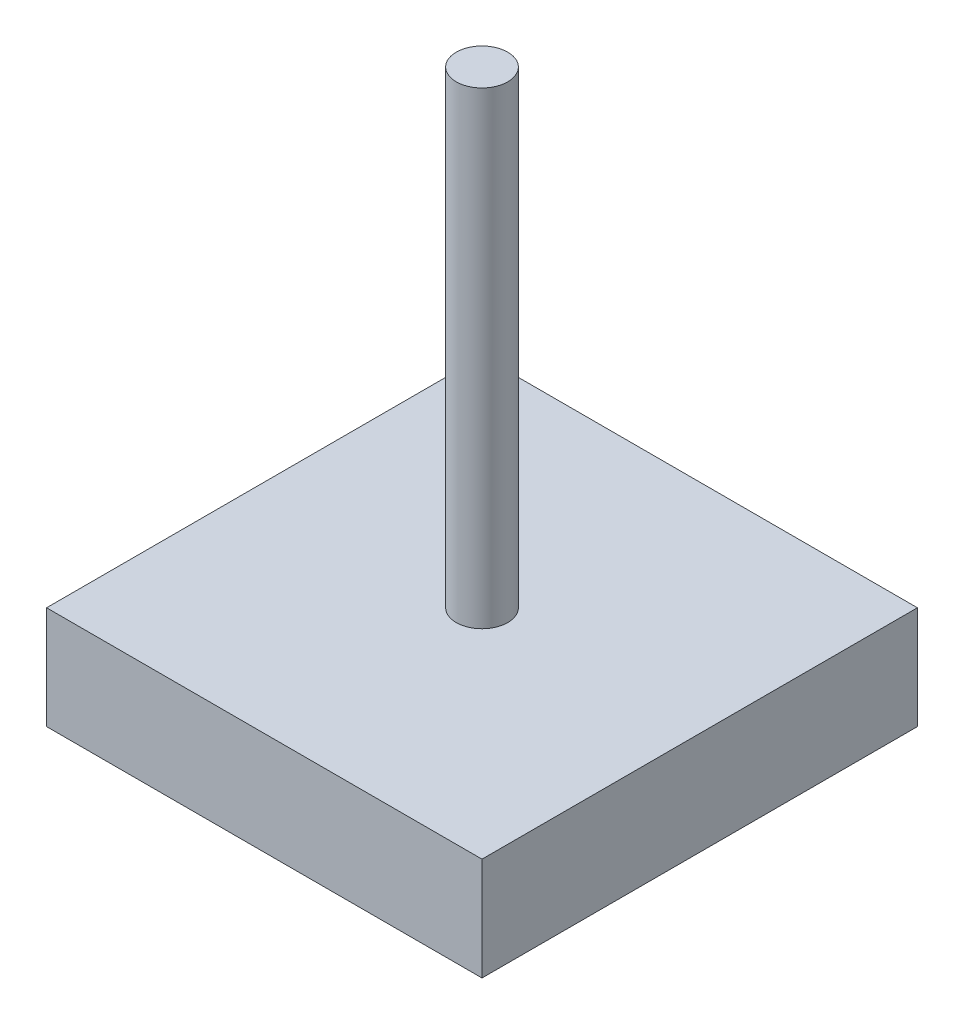
ISO-10303-21;
HEADER;
FILE_DESCRIPTION(('STEP AP214'),'2;1');
FILE_NAME('part.step','',(''),(''),'','','');
FILE_SCHEMA(('AUTOMOTIVE_DESIGN { 1 0 10303 214 1 1 1 1 }'));
ENDSEC;
DATA;
#1=APPLICATION_CONTEXT('core data for automotive mechanical design processes');
#2=APPLICATION_PROTOCOL_DEFINITION('international standard','automotive_design',2000,#1);
#3=PRODUCT_CONTEXT('',#1,'mechanical');
#4=PRODUCT('Part','Part','',(#3));
#5=PRODUCT_RELATED_PRODUCT_CATEGORY('part','',(#4));
#6=PRODUCT_DEFINITION_FORMATION('','',#4);
#7=PRODUCT_DEFINITION_CONTEXT('part definition',#1,'design');
#8=PRODUCT_DEFINITION('design','',#6,#7);
#9=PRODUCT_DEFINITION_SHAPE('','',#8);
#10=(LENGTH_UNIT() NAMED_UNIT(*) SI_UNIT(.MILLI.,.METRE.));
#11=(NAMED_UNIT(*) PLANE_ANGLE_UNIT() SI_UNIT($,.RADIAN.));
#12=(NAMED_UNIT(*) SI_UNIT($,.STERADIAN.) SOLID_ANGLE_UNIT());
#13=UNCERTAINTY_MEASURE_WITH_UNIT(LENGTH_MEASURE(1.E-05),#10,'distance_accuracy_value','');
#14=(GEOMETRIC_REPRESENTATION_CONTEXT(3) GLOBAL_UNCERTAINTY_ASSIGNED_CONTEXT((#13)) GLOBAL_UNIT_ASSIGNED_CONTEXT((#10,
#11,#12)) REPRESENTATION_CONTEXT('',''));
#15=CARTESIAN_POINT('',(0.,0.,0.));
#16=DIRECTION('',(0.,0.,1.));
#17=DIRECTION('',(1.,0.,0.));
#18=AXIS2_PLACEMENT_3D('',#15,#16,#17);
#19=CARTESIAN_POINT('',(0.,10.,0.));
#20=DIRECTION('',(0.,-1.,0.));
#21=DIRECTION('',(0.,0.,-1.));
#22=AXIS2_PLACEMENT_3D('',#19,#20,#21);
#23=PLANE('',#22);
#24=DIRECTION('',(0.,0.,1.));
#25=VECTOR('',#24,1.);
#26=CARTESIAN_POINT('',(-21.15,10.,-21.15));
#27=LINE('',#26,#25);
#28=CARTESIAN_POINT('',(-21.15,10.,-21.15));
#29=VERTEX_POINT('',#28);
#30=CARTESIAN_POINT('',(-21.15,10.,21.15));
#31=VERTEX_POINT('',#30);
#32=EDGE_CURVE('E86',#29,#31,#27,.T.);
#33=ORIENTED_EDGE('',*,*,#32,.T.);
#34=DIRECTION('',(1.,0.,0.));
#35=VECTOR('',#34,1.);
#36=CARTESIAN_POINT('',(21.15,10.,21.15));
#37=LINE('',#36,#35);
#38=CARTESIAN_POINT('',(21.15,10.,21.15));
#39=VERTEX_POINT('',#38);
#40=EDGE_CURVE('E81',#31,#39,#37,.T.);
#41=ORIENTED_EDGE('',*,*,#40,.T.);
#42=DIRECTION('',(0.,0.,-1.));
#43=VECTOR('',#42,1.);
#44=CARTESIAN_POINT('',(21.15,10.,-21.15));
#45=LINE('',#44,#43);
#46=CARTESIAN_POINT('',(21.15,10.,-21.15));
#47=VERTEX_POINT('',#46);
#48=EDGE_CURVE('E84',#39,#47,#45,.T.);
#49=ORIENTED_EDGE('',*,*,#48,.T.);
#50=DIRECTION('',(-1.,0.,0.));
#51=VECTOR('',#50,1.);
#52=CARTESIAN_POINT('',(21.15,10.,-21.15));
#53=LINE('',#52,#51);
#54=EDGE_CURVE('E50',#47,#29,#53,.T.);
#55=ORIENTED_EDGE('',*,*,#54,.T.);
#56=EDGE_LOOP('',(#33,#41,#49,#55));
#57=FACE_BOUND('',#56,.T.);
#58=CARTESIAN_POINT('',(0.,10.,0.));
#59=DIRECTION('',(0.,-1.,0.));
#60=DIRECTION('',(0.,0.,-1.));
#61=AXIS2_PLACEMENT_3D('',#58,#59,#60);
#62=CIRCLE('',#61,2.5);
#63=CARTESIAN_POINT('',(0.,10.,-2.5));
#64=VERTEX_POINT('',#63);
#65=EDGE_CURVE('E11',#64,#64,#62,.F.);
#66=ORIENTED_EDGE('',*,*,#65,.F.);
#67=EDGE_LOOP('',(#66));
#68=FACE_BOUND('',#67,.T.);
#69=ADVANCED_FACE('F33',(#57,#68),#23,.F.);
#70=CARTESIAN_POINT('',(-21.15,10.,-21.15));
#71=DIRECTION('',(1.,0.,0.));
#72=DIRECTION('',(0.,0.,-1.));
#73=AXIS2_PLACEMENT_3D('',#70,#71,#72);
#74=PLANE('',#73);
#75=DIRECTION('',(0.,0.,1.));
#76=VECTOR('',#75,1.);
#77=CARTESIAN_POINT('',(-21.15,0.,-21.15));
#78=LINE('',#77,#76);
#79=CARTESIAN_POINT('',(-21.15,0.,-21.15));
#80=VERTEX_POINT('',#79);
#81=CARTESIAN_POINT('',(-21.15,0.,21.15));
#82=VERTEX_POINT('',#81);
#83=EDGE_CURVE('E100',#80,#82,#78,.T.);
#84=ORIENTED_EDGE('',*,*,#83,.T.);
#85=DIRECTION('',(0.,-1.,0.));
#86=VECTOR('',#85,1.);
#87=CARTESIAN_POINT('',(-21.15,10.,21.15));
#88=LINE('',#87,#86);
#89=EDGE_CURVE('E42',#31,#82,#88,.T.);
#90=ORIENTED_EDGE('',*,*,#89,.F.);
#91=ORIENTED_EDGE('',*,*,#32,.F.);
#92=DIRECTION('',(0.,-1.,0.));
#93=VECTOR('',#92,1.);
#94=CARTESIAN_POINT('',(-21.15,10.,-21.15));
#95=LINE('',#94,#93);
#96=EDGE_CURVE('E96',#29,#80,#95,.T.);
#97=ORIENTED_EDGE('',*,*,#96,.T.);
#98=EDGE_LOOP('',(#84,#90,#91,#97));
#99=FACE_BOUND('',#98,.T.);
#100=ADVANCED_FACE('F35',(#99),#74,.F.);
#101=CARTESIAN_POINT('',(21.15,10.,21.15));
#102=DIRECTION('',(0.,0.,-1.));
#103=DIRECTION('',(-1.,0.,0.));
#104=AXIS2_PLACEMENT_3D('',#101,#102,#103);
#105=PLANE('',#104);
#106=DIRECTION('',(1.,0.,0.));
#107=VECTOR('',#106,1.);
#108=CARTESIAN_POINT('',(21.15,0.,21.15));
#109=LINE('',#108,#107);
#110=CARTESIAN_POINT('',(21.15,0.,21.15));
#111=VERTEX_POINT('',#110);
#112=EDGE_CURVE('E91',#82,#111,#109,.T.);
#113=ORIENTED_EDGE('',*,*,#112,.T.);
#114=DIRECTION('',(0.,-1.,0.));
#115=VECTOR('',#114,1.);
#116=CARTESIAN_POINT('',(21.15,10.,21.15));
#117=LINE('',#116,#115);
#118=EDGE_CURVE('E89',#39,#111,#117,.T.);
#119=ORIENTED_EDGE('',*,*,#118,.F.);
#120=ORIENTED_EDGE('',*,*,#40,.F.);
#121=ORIENTED_EDGE('',*,*,#89,.T.);
#122=EDGE_LOOP('',(#113,#119,#120,#121));
#123=FACE_BOUND('',#122,.T.);
#124=ADVANCED_FACE('F90',(#123),#105,.F.);
#125=CARTESIAN_POINT('',(21.15,10.,-21.15));
#126=DIRECTION('',(-1.,0.,0.));
#127=DIRECTION('',(0.,0.,1.));
#128=AXIS2_PLACEMENT_3D('',#125,#126,#127);
#129=PLANE('',#128);
#130=DIRECTION('',(0.,0.,-1.));
#131=VECTOR('',#130,1.);
#132=CARTESIAN_POINT('',(21.15,0.,-21.15));
#133=LINE('',#132,#131);
#134=CARTESIAN_POINT('',(21.15,0.,-21.15));
#135=VERTEX_POINT('',#134);
#136=EDGE_CURVE('E67',#111,#135,#133,.T.);
#137=ORIENTED_EDGE('',*,*,#136,.T.);
#138=DIRECTION('',(0.,-1.,0.));
#139=VECTOR('',#138,1.);
#140=CARTESIAN_POINT('',(21.15,10.,-21.15));
#141=LINE('',#140,#139);
#142=EDGE_CURVE('E92',#47,#135,#141,.T.);
#143=ORIENTED_EDGE('',*,*,#142,.F.);
#144=ORIENTED_EDGE('',*,*,#48,.F.);
#145=ORIENTED_EDGE('',*,*,#118,.T.);
#146=EDGE_LOOP('',(#137,#143,#144,#145));
#147=FACE_BOUND('',#146,.T.);
#148=ADVANCED_FACE('F94',(#147),#129,.F.);
#149=CARTESIAN_POINT('',(21.15,10.,-21.15));
#150=DIRECTION('',(0.,0.,1.));
#151=DIRECTION('',(1.,0.,0.));
#152=AXIS2_PLACEMENT_3D('',#149,#150,#151);
#153=PLANE('',#152);
#154=DIRECTION('',(-1.,0.,0.));
#155=VECTOR('',#154,1.);
#156=CARTESIAN_POINT('',(21.15,0.,-21.15));
#157=LINE('',#156,#155);
#158=EDGE_CURVE('E73',#135,#80,#157,.T.);
#159=ORIENTED_EDGE('',*,*,#158,.T.);
#160=ORIENTED_EDGE('',*,*,#96,.F.);
#161=ORIENTED_EDGE('',*,*,#54,.F.);
#162=ORIENTED_EDGE('',*,*,#142,.T.);
#163=EDGE_LOOP('',(#159,#160,#161,#162));
#164=FACE_BOUND('',#163,.T.);
#165=ADVANCED_FACE('F114',(#164),#153,.F.);
#166=CARTESIAN_POINT('',(0.,0.,0.));
#167=DIRECTION('',(0.,-1.,0.));
#168=DIRECTION('',(0.,0.,-1.));
#169=AXIS2_PLACEMENT_3D('',#166,#167,#168);
#170=PLANE('',#169);
#171=ORIENTED_EDGE('',*,*,#83,.F.);
#172=ORIENTED_EDGE('',*,*,#158,.F.);
#173=ORIENTED_EDGE('',*,*,#136,.F.);
#174=ORIENTED_EDGE('',*,*,#112,.F.);
#175=EDGE_LOOP('',(#171,#172,#173,#174));
#176=FACE_BOUND('',#175,.T.);
#177=ADVANCED_FACE('F111',(#176),#170,.T.);
#178=CARTESIAN_POINT('',(0.,55.5,0.));
#179=DIRECTION('',(0.,-1.,0.));
#180=DIRECTION('',(0.,0.,-1.));
#181=AXIS2_PLACEMENT_3D('',#178,#179,#180);
#182=CYLINDRICAL_SURFACE('',#181,2.5);
#183=CARTESIAN_POINT('',(0.,55.5,0.));
#184=DIRECTION('',(0.,1.,0.));
#185=DIRECTION('',(0.,0.,1.));
#186=AXIS2_PLACEMENT_3D('',#183,#184,#185);
#187=CIRCLE('',#186,2.5);
#188=CARTESIAN_POINT('',(0.,55.5,2.5));
#189=VERTEX_POINT('',#188);
#190=EDGE_CURVE('E103',#189,#189,#187,.T.);
#191=ORIENTED_EDGE('',*,*,#190,.F.);
#192=EDGE_LOOP('',(#191));
#193=FACE_BOUND('',#192,.T.);
#194=ORIENTED_EDGE('',*,*,#65,.T.);
#195=EDGE_LOOP('',(#194));
#196=FACE_BOUND('',#195,.T.);
#197=ADVANCED_FACE('F113',(#193,#196),#182,.T.);
#198=CARTESIAN_POINT('',(0.,55.5,0.));
#199=DIRECTION('',(0.,1.,0.));
#200=DIRECTION('',(0.,0.,1.));
#201=AXIS2_PLACEMENT_3D('',#198,#199,#200);
#202=PLANE('',#201);
#203=ORIENTED_EDGE('',*,*,#190,.T.);
#204=EDGE_LOOP('',(#203));
#205=FACE_BOUND('',#204,.T.);
#206=ADVANCED_FACE('F120',(#205),#202,.T.);
#207=CLOSED_SHELL('',(#69,#100,#124,#148,#165,#177,#197,#206));
#208=MANIFOLD_SOLID_BREP('B2',#207);
#209=ADVANCED_BREP_SHAPE_REPRESENTATION('',(#18,#208),#14);
#210=SHAPE_DEFINITION_REPRESENTATION(#9,#209);
ENDSEC;
END-ISO-10303-21;
